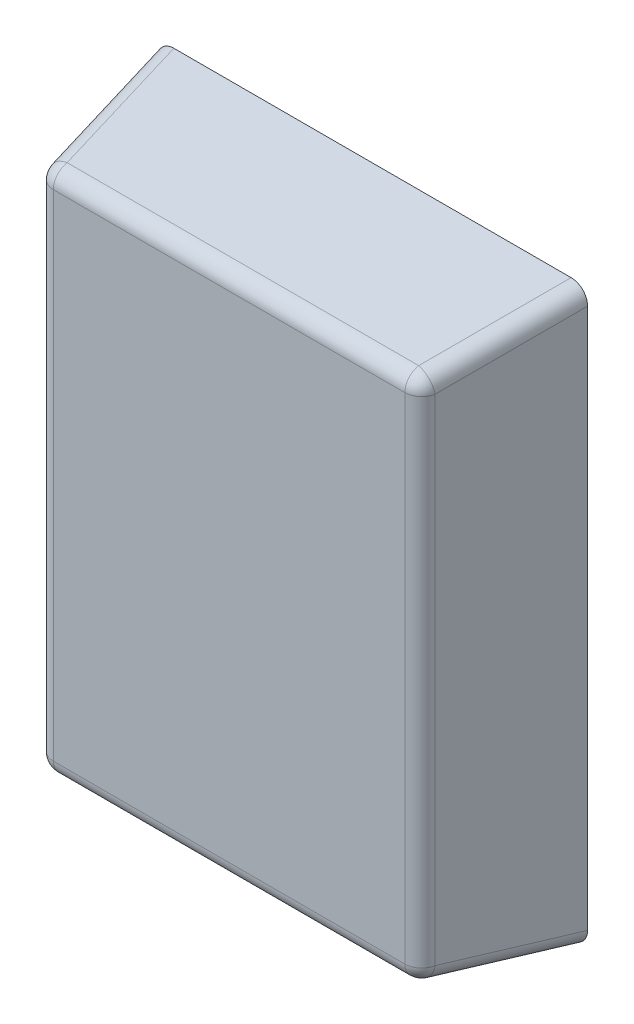
ISO-10303-21;
HEADER;
FILE_DESCRIPTION(('STEP AP214'),'2;1');
FILE_NAME('part.step','',(''),(''),'','','');
FILE_SCHEMA(('AUTOMOTIVE_DESIGN { 1 0 10303 214 1 1 1 1 }'));
ENDSEC;
DATA;
#1=APPLICATION_CONTEXT('core data for automotive mechanical design processes');
#2=APPLICATION_PROTOCOL_DEFINITION('international standard','automotive_design',2000,#1);
#3=PRODUCT_CONTEXT('',#1,'mechanical');
#4=PRODUCT('Part','Part','',(#3));
#5=PRODUCT_RELATED_PRODUCT_CATEGORY('part','',(#4));
#6=PRODUCT_DEFINITION_FORMATION('','',#4);
#7=PRODUCT_DEFINITION_CONTEXT('part definition',#1,'design');
#8=PRODUCT_DEFINITION('design','',#6,#7);
#9=PRODUCT_DEFINITION_SHAPE('','',#8);
#10=(LENGTH_UNIT() NAMED_UNIT(*) SI_UNIT(.MILLI.,.METRE.));
#11=(NAMED_UNIT(*) PLANE_ANGLE_UNIT() SI_UNIT($,.RADIAN.));
#12=(NAMED_UNIT(*) SI_UNIT($,.STERADIAN.) SOLID_ANGLE_UNIT());
#13=UNCERTAINTY_MEASURE_WITH_UNIT(LENGTH_MEASURE(1.E-05),#10,'distance_accuracy_value','');
#14=(GEOMETRIC_REPRESENTATION_CONTEXT(3) GLOBAL_UNCERTAINTY_ASSIGNED_CONTEXT((#13)) GLOBAL_UNIT_ASSIGNED_CONTEXT((#10,
#11,#12)) REPRESENTATION_CONTEXT('',''));
#15=CARTESIAN_POINT('',(0.,0.,0.));
#16=DIRECTION('',(0.,0.,1.));
#17=DIRECTION('',(1.,0.,0.));
#18=AXIS2_PLACEMENT_3D('',#15,#16,#17);
#19=CARTESIAN_POINT('',(1.12653571469062,-0.641019643054923,0.245));
#20=DIRECTION('',(0.,0.,1.));
#21=DIRECTION('',(1.,0.,0.));
#22=AXIS2_PLACEMENT_3D('',#19,#20,#21);
#23=PLANE('',#22);
#24=DIRECTION('',(0.,1.,0.));
#25=VECTOR('',#24,1.);
#26=CARTESIAN_POINT('',(1.20008239842987,-0.581022128259369,0.245));
#27=LINE('',#26,#25);
#28=CARTESIAN_POINT('',(1.20008239842987,-0.537477929724562,0.245));
#29=VERTEX_POINT('',#28);
#30=CARTESIAN_POINT('',(1.20008239842987,-0.744561356385284,0.245));
#31=VERTEX_POINT('',#30);
#32=EDGE_CURVE('E236',#29,#31,#27,.F.);
#33=ORIENTED_EDGE('',*,*,#32,.F.);
#34=DIRECTION('',(-1.,0.,0.));
#35=VECTOR('',#34,1.);
#36=CARTESIAN_POINT('',(1.08153571469062,-0.537477929724562,0.245));
#37=LINE('',#36,#35);
#38=CARTESIAN_POINT('',(1.05298903095137,-0.537477929724562,0.245));
#39=VERTEX_POINT('',#38);
#40=EDGE_CURVE('E224',#39,#29,#37,.F.);
#41=ORIENTED_EDGE('',*,*,#40,.F.);
#42=DIRECTION('',(0.,-1.,0.));
#43=VECTOR('',#42,1.);
#44=CARTESIAN_POINT('',(1.05298903095137,-0.701017157850478,0.245));
#45=LINE('',#44,#43);
#46=CARTESIAN_POINT('',(1.05298903095137,-0.744561356385284,0.245));
#47=VERTEX_POINT('',#46);
#48=EDGE_CURVE('E229',#47,#39,#45,.F.);
#49=ORIENTED_EDGE('',*,*,#48,.F.);
#50=DIRECTION('',(1.,0.,0.));
#51=VECTOR('',#50,1.);
#52=CARTESIAN_POINT('',(1.17153571469062,-0.744561356385284,0.245));
#53=LINE('',#52,#51);
#54=EDGE_CURVE('E241',#31,#47,#53,.F.);
#55=ORIENTED_EDGE('',*,*,#54,.F.);
#56=EDGE_LOOP('',(#33,#41,#49,#55));
#57=FACE_BOUND('',#56,.T.);
#58=ADVANCED_FACE('F17',(#57),#23,.T.);
#59=CARTESIAN_POINT('',(1.05298903095137,-0.701017157850478,0.238));
#60=DIRECTION('',(0.,-1.,0.));
#61=DIRECTION('',(1.,0.,0.));
#62=AXIS2_PLACEMENT_3D('',#59,#60,#61);
#63=CYLINDRICAL_SURFACE('',#62,0.007);
#64=DIRECTION('',(0.,1.,0.));
#65=VECTOR('',#64,1.);
#66=CARTESIAN_POINT('',(1.04609537668028,-0.761014672646032,0.239215537243667));
#67=LINE('',#66,#65);
#68=CARTESIAN_POINT('',(1.04609537668028,-0.744561356385283,0.239215537243667));
#69=VERTEX_POINT('',#68);
#70=CARTESIAN_POINT('',(1.04609537668028,-0.537477929724562,0.239215537243668));
#71=VERTEX_POINT('',#70);
#72=EDGE_CURVE('E114',#69,#71,#67,.T.);
#73=ORIENTED_EDGE('',*,*,#72,.F.);
#74=CARTESIAN_POINT('',(1.05298903095137,-0.744561356385283,0.238));
#75=DIRECTION('',(0.,-1.,-1.82015343698568E-13));
#76=DIRECTION('',(1.,0.,0.));
#77=AXIS2_PLACEMENT_3D('',#74,#75,#76);
#78=CIRCLE('',#77,0.007);
#79=EDGE_CURVE('E221',#47,#69,#78,.T.);
#80=ORIENTED_EDGE('',*,*,#79,.F.);
#81=ORIENTED_EDGE('',*,*,#48,.T.);
#82=CARTESIAN_POINT('',(1.05298903095137,-0.537477929724562,0.238));
#83=DIRECTION('',(0.,-1.,0.));
#84=DIRECTION('',(1.,0.,0.));
#85=AXIS2_PLACEMENT_3D('',#82,#83,#84);
#86=CIRCLE('',#85,0.007);
#87=EDGE_CURVE('E74',#71,#39,#86,.F.);
#88=ORIENTED_EDGE('',*,*,#87,.F.);
#89=EDGE_LOOP('',(#73,#80,#81,#88));
#90=FACE_BOUND('',#89,.T.);
#91=ADVANCED_FACE('F214',(#90),#63,.T.);
#92=CARTESIAN_POINT('',(1.05298903095137,-0.744561356385283,0.238));
#93=DIRECTION('',(1.,0.,0.));
#94=DIRECTION('',(0.,1.,0.));
#95=AXIS2_PLACEMENT_3D('',#92,#93,#94);
#96=SPHERICAL_SURFACE('',#95,0.007);
#97=ORIENTED_EDGE('',*,*,#79,.T.);
#98=CARTESIAN_POINT('',(1.05298903095137,-0.744561356385283,0.238));
#99=DIRECTION('',(-0.171087869746035,-0.171087869746037,-0.970287525247814));
#100=DIRECTION('',(0.,0.984807753012208,-0.173648177666932));
#101=AXIS2_PLACEMENT_3D('',#98,#99,#100);
#102=CIRCLE('',#101,0.007);
#103=CARTESIAN_POINT('',(1.05298903095137,-0.751455010656369,0.239215537243669));
#104=VERTEX_POINT('',#103);
#105=EDGE_CURVE('E20',#104,#69,#102,.T.);
#106=ORIENTED_EDGE('',*,*,#105,.F.);
#107=CARTESIAN_POINT('',(1.05298903095137,-0.744561356385284,0.238));
#108=DIRECTION('',(1.,0.,0.));
#109=DIRECTION('',(0.,1.,0.));
#110=AXIS2_PLACEMENT_3D('',#107,#108,#109);
#111=CIRCLE('',#110,0.007);
#112=EDGE_CURVE('E223',#47,#104,#111,.T.);
#113=ORIENTED_EDGE('',*,*,#112,.F.);
#114=EDGE_LOOP('',(#97,#106,#113));
#115=FACE_BOUND('',#114,.T.);
#116=ADVANCED_FACE('F210',(#115),#96,.T.);
#117=CARTESIAN_POINT('',(1.17153571469062,-0.744561356385284,0.238));
#118=DIRECTION('',(1.,0.,0.));
#119=DIRECTION('',(0.,1.,0.));
#120=AXIS2_PLACEMENT_3D('',#117,#118,#119);
#121=CYLINDRICAL_SURFACE('',#120,0.007);
#122=DIRECTION('',(1.,0.,0.));
#123=VECTOR('',#122,1.);
#124=CARTESIAN_POINT('',(1.21653571469062,-0.75145501065637,0.239215537243668));
#125=LINE('',#124,#123);
#126=CARTESIAN_POINT('',(1.20008239842987,-0.751455010656369,0.239215537243668));
#127=VERTEX_POINT('',#126);
#128=EDGE_CURVE('E146',#127,#104,#125,.F.);
#129=ORIENTED_EDGE('',*,*,#128,.F.);
#130=CARTESIAN_POINT('',(1.20008239842987,-0.744561356385284,0.238));
#131=DIRECTION('',(1.,0.,0.));
#132=DIRECTION('',(0.,1.,0.));
#133=AXIS2_PLACEMENT_3D('',#130,#131,#132);
#134=CIRCLE('',#133,0.00699999999999995);
#135=EDGE_CURVE('E198',#31,#127,#134,.T.);
#136=ORIENTED_EDGE('',*,*,#135,.F.);
#137=ORIENTED_EDGE('',*,*,#54,.T.);
#138=ORIENTED_EDGE('',*,*,#112,.T.);
#139=EDGE_LOOP('',(#129,#136,#137,#138));
#140=FACE_BOUND('',#139,.T.);
#141=ADVANCED_FACE('F206',(#140),#121,.T.);
#142=CARTESIAN_POINT('',(1.20008239842987,-0.744561356385284,0.238));
#143=DIRECTION('',(1.,0.,0.));
#144=DIRECTION('',(0.,1.,0.));
#145=AXIS2_PLACEMENT_3D('',#142,#143,#144);
#146=SPHERICAL_SURFACE('',#145,0.007);
#147=ORIENTED_EDGE('',*,*,#135,.T.);
#148=CARTESIAN_POINT('',(1.20008239842987,-0.744561356385283,0.238));
#149=DIRECTION('',(0.171087869746039,-0.171087869746042,-0.970287525247812));
#150=DIRECTION('',(0.,0.984807753012207,-0.173648177666937));
#151=AXIS2_PLACEMENT_3D('',#148,#149,#150);
#152=CIRCLE('',#151,0.007);
#153=CARTESIAN_POINT('',(1.20697605270095,-0.744561356385284,0.239215537243669));
#154=VERTEX_POINT('',#153);
#155=EDGE_CURVE('E136',#154,#127,#152,.T.);
#156=ORIENTED_EDGE('',*,*,#155,.F.);
#157=CARTESIAN_POINT('',(1.20008239842987,-0.744561356385284,0.238));
#158=DIRECTION('',(0.,1.,0.));
#159=DIRECTION('',(-1.,0.,0.));
#160=AXIS2_PLACEMENT_3D('',#157,#158,#159);
#161=CIRCLE('',#160,0.007);
#162=EDGE_CURVE('E194',#31,#154,#161,.T.);
#163=ORIENTED_EDGE('',*,*,#162,.F.);
#164=EDGE_LOOP('',(#147,#156,#163));
#165=FACE_BOUND('',#164,.T.);
#166=ADVANCED_FACE('F203',(#165),#146,.T.);
#167=CARTESIAN_POINT('',(1.20008239842987,-0.581022128259369,0.238));
#168=DIRECTION('',(0.,1.,0.));
#169=DIRECTION('',(-1.,0.,0.));
#170=AXIS2_PLACEMENT_3D('',#167,#168,#169);
#171=CYLINDRICAL_SURFACE('',#170,0.007);
#172=DIRECTION('',(0.,1.,0.));
#173=VECTOR('',#172,1.);
#174=CARTESIAN_POINT('',(1.20697605270096,-0.521024613463814,0.239215537243669));
#175=LINE('',#174,#173);
#176=CARTESIAN_POINT('',(1.20697605270096,-0.537477929724562,0.239215537243669));
#177=VERTEX_POINT('',#176);
#178=EDGE_CURVE('E137',#177,#154,#175,.F.);
#179=ORIENTED_EDGE('',*,*,#178,.F.);
#180=CARTESIAN_POINT('',(1.20008239842987,-0.537477929724562,0.238));
#181=DIRECTION('',(0.,-1.,0.));
#182=DIRECTION('',(1.,0.,0.));
#183=AXIS2_PLACEMENT_3D('',#180,#181,#182);
#184=CIRCLE('',#183,0.007);
#185=EDGE_CURVE('E190',#29,#177,#184,.F.);
#186=ORIENTED_EDGE('',*,*,#185,.F.);
#187=ORIENTED_EDGE('',*,*,#32,.T.);
#188=ORIENTED_EDGE('',*,*,#162,.T.);
#189=EDGE_LOOP('',(#179,#186,#187,#188));
#190=FACE_BOUND('',#189,.T.);
#191=ADVANCED_FACE('F182',(#190),#171,.T.);
#192=CARTESIAN_POINT('',(1.20008239842987,-0.537477929724562,0.238));
#193=DIRECTION('',(1.,0.,0.));
#194=DIRECTION('',(0.,1.,0.));
#195=AXIS2_PLACEMENT_3D('',#192,#193,#194);
#196=SPHERICAL_SURFACE('',#195,0.007);
#197=CARTESIAN_POINT('',(1.20008239842987,-0.537477929724562,0.238));
#198=DIRECTION('',(-1.,0.,0.));
#199=DIRECTION('',(0.,-1.,0.));
#200=AXIS2_PLACEMENT_3D('',#197,#198,#199);
#201=CIRCLE('',#200,0.007);
#202=CARTESIAN_POINT('',(1.20008239842987,-0.530584275453477,0.239215537243668));
#203=VERTEX_POINT('',#202);
#204=EDGE_CURVE('E193',#29,#203,#201,.T.);
#205=ORIENTED_EDGE('',*,*,#204,.F.);
#206=ORIENTED_EDGE('',*,*,#185,.T.);
#207=CARTESIAN_POINT('',(1.20008239842987,-0.537477929724563,0.238));
#208=DIRECTION('',(0.17108786974604,0.171087869746041,-0.970287525247812));
#209=DIRECTION('',(0.,0.984807753012207,0.173648177666936));
#210=AXIS2_PLACEMENT_3D('',#207,#208,#209);
#211=CIRCLE('',#210,0.007);
#212=EDGE_CURVE('E133',#203,#177,#211,.T.);
#213=ORIENTED_EDGE('',*,*,#212,.F.);
#214=EDGE_LOOP('',(#205,#206,#213));
#215=FACE_BOUND('',#214,.T.);
#216=ADVANCED_FACE('F178',(#215),#196,.T.);
#217=CARTESIAN_POINT('',(1.08153571469062,-0.537477929724562,0.238));
#218=DIRECTION('',(-1.,0.,0.));
#219=DIRECTION('',(0.,-1.,0.));
#220=AXIS2_PLACEMENT_3D('',#217,#218,#219);
#221=CYLINDRICAL_SURFACE('',#220,0.007);
#222=DIRECTION('',(1.,0.,0.));
#223=VECTOR('',#222,1.);
#224=CARTESIAN_POINT('',(1.03653571469062,-0.530584275453476,0.239215537243668));
#225=LINE('',#224,#223);
#226=CARTESIAN_POINT('',(1.05298903095137,-0.530584275453477,0.239215537243668));
#227=VERTEX_POINT('',#226);
#228=EDGE_CURVE('E134',#227,#203,#225,.T.);
#229=ORIENTED_EDGE('',*,*,#228,.F.);
#230=CARTESIAN_POINT('',(1.05298903095137,-0.537477929724562,0.238));
#231=DIRECTION('',(1.,0.,0.));
#232=DIRECTION('',(0.,1.,0.));
#233=AXIS2_PLACEMENT_3D('',#230,#231,#232);
#234=CIRCLE('',#233,0.00699999999999995);
#235=EDGE_CURVE('E82',#39,#227,#234,.F.);
#236=ORIENTED_EDGE('',*,*,#235,.F.);
#237=ORIENTED_EDGE('',*,*,#40,.T.);
#238=ORIENTED_EDGE('',*,*,#204,.T.);
#239=EDGE_LOOP('',(#229,#236,#237,#238));
#240=FACE_BOUND('',#239,.T.);
#241=ADVANCED_FACE('F173',(#240),#221,.T.);
#242=CARTESIAN_POINT('',(1.05298903095137,-0.537477929724562,0.238));
#243=DIRECTION('',(1.,0.,0.));
#244=DIRECTION('',(0.,1.,0.));
#245=AXIS2_PLACEMENT_3D('',#242,#243,#244);
#246=SPHERICAL_SURFACE('',#245,0.007);
#247=ORIENTED_EDGE('',*,*,#87,.T.);
#248=ORIENTED_EDGE('',*,*,#235,.T.);
#249=CARTESIAN_POINT('',(1.05298903095136,-0.537477929724562,0.238));
#250=DIRECTION('',(-0.171087869746029,0.171087869746031,-0.970287525247816));
#251=DIRECTION('',(0.,0.984807753012209,0.173648177666926));
#252=AXIS2_PLACEMENT_3D('',#249,#250,#251);
#253=CIRCLE('',#252,0.007);
#254=EDGE_CURVE('E126',#71,#227,#253,.T.);
#255=ORIENTED_EDGE('',*,*,#254,.F.);
#256=EDGE_LOOP('',(#247,#248,#255));
#257=FACE_BOUND('',#256,.T.);
#258=ADVANCED_FACE('F169',(#257),#246,.T.);
#259=CARTESIAN_POINT('',(1.03653571469062,-0.761014672646032,0.185));
#260=DIRECTION('',(-0.984807753012208,0.,0.173648177666928));
#261=DIRECTION('',(0.173648177666928,0.,0.984807753012208));
#262=AXIS2_PLACEMENT_3D('',#259,#260,#261);
#263=PLANE('',#262);
#264=DIRECTION('',(-0.171087869746035,-0.171087869746037,-0.970287525247814));
#265=VECTOR('',#264,1.);
#266=CARTESIAN_POINT('',(1.0389683254542,-0.751688407611361,0.198796021197729));
#267=LINE('',#266,#265);
#268=CARTESIAN_POINT('',(1.03653571469062,-0.754121018374946,0.185));
#269=VERTEX_POINT('',#268);
#270=EDGE_CURVE('E104',#69,#269,#267,.T.);
#271=ORIENTED_EDGE('',*,*,#270,.F.);
#272=ORIENTED_EDGE('',*,*,#72,.T.);
#273=DIRECTION('',(-0.171087869746033,0.171087869746029,-0.970287525247815));
#274=VECTOR('',#273,1.);
#275=CARTESIAN_POINT('',(1.04609537668028,-0.537477929724562,0.239215537243667));
#276=LINE('',#275,#274);
#277=CARTESIAN_POINT('',(1.03653571469062,-0.527918267734899,0.185));
#278=VERTEX_POINT('',#277);
#279=EDGE_CURVE('E111',#71,#278,#276,.T.);
#280=ORIENTED_EDGE('',*,*,#279,.T.);
#281=DIRECTION('',(0.,1.,0.));
#282=VECTOR('',#281,1.);
#283=CARTESIAN_POINT('',(1.03653571469062,-0.641019643054923,0.185));
#284=LINE('',#283,#282);
#285=EDGE_CURVE('E113',#278,#269,#284,.F.);
#286=ORIENTED_EDGE('',*,*,#285,.T.);
#287=EDGE_LOOP('',(#271,#272,#280,#286));
#288=FACE_BOUND('',#287,.T.);
#289=ADVANCED_FACE('F112',(#288),#263,.T.);
#290=CARTESIAN_POINT('',(1.04586197972529,-0.751688407611361,0.197580483954061));
#291=DIRECTION('',(-0.171087869746035,-0.171087869746037,-0.970287525247814));
#292=DIRECTION('',(0.,0.984807753012208,-0.173648177666932));
#293=AXIS2_PLACEMENT_3D('',#290,#291,#292);
#294=CYLINDRICAL_SURFACE('',#293,0.007);
#295=DIRECTION('',(-0.171087869746156,-0.171087869746034,-0.970287525247793));
#296=VECTOR('',#295,1.);
#297=CARTESIAN_POINT('',(1.05298903095137,-0.751455010656369,0.239215537243668));
#298=LINE('',#297,#296);
#299=CARTESIAN_POINT('',(1.0434293689617,-0.761014672646032,0.185));
#300=VERTEX_POINT('',#299);
#301=EDGE_CURVE('E151',#104,#300,#298,.T.);
#302=ORIENTED_EDGE('',*,*,#301,.F.);
#303=ORIENTED_EDGE('',*,*,#105,.T.);
#304=ORIENTED_EDGE('',*,*,#270,.T.);
#305=CARTESIAN_POINT('',(1.04364370097382,-0.753906686362832,0.185));
#306=DIRECTION('',(0.,0.,1.));
#307=DIRECTION('',(-0.707106781186543,-0.707106781186552,0.));
#308=AXIS2_PLACEMENT_3D('',#305,#306,#307);
#309=ELLIPSE('',#308,0.00721435638184896,0.007);
#310=EDGE_CURVE('E120',#269,#300,#309,.T.);
#311=ORIENTED_EDGE('',*,*,#310,.T.);
#312=EDGE_LOOP('',(#302,#303,#304,#311));
#313=FACE_BOUND('',#312,.T.);
#314=ADVANCED_FACE('F279',(#313),#294,.T.);
#315=CARTESIAN_POINT('',(1.21653571469062,-0.761014672646033,0.185));
#316=DIRECTION('',(0.,-0.984807753012208,0.173648177666931));
#317=DIRECTION('',(0.,-0.173648177666931,-0.984807753012208));
#318=AXIS2_PLACEMENT_3D('',#315,#316,#317);
#319=PLANE('',#318);
#320=DIRECTION('',(0.171087869746039,-0.171087869746042,-0.970287525247812));
#321=VECTOR('',#320,1.);
#322=CARTESIAN_POINT('',(1.20633146336985,-0.757704075596352,0.20377532885993));
#323=LINE('',#322,#321);
#324=CARTESIAN_POINT('',(1.20964206041953,-0.761014672646032,0.185));
#325=VERTEX_POINT('',#324);
#326=EDGE_CURVE('E138',#127,#325,#323,.T.);
#327=ORIENTED_EDGE('',*,*,#326,.F.);
#328=ORIENTED_EDGE('',*,*,#128,.T.);
#329=ORIENTED_EDGE('',*,*,#301,.T.);
#330=DIRECTION('',(1.,0.,0.));
#331=VECTOR('',#330,1.);
#332=CARTESIAN_POINT('',(1.12653571469062,-0.761014672646032,0.185));
#333=LINE('',#332,#331);
#334=EDGE_CURVE('E156',#300,#325,#333,.T.);
#335=ORIENTED_EDGE('',*,*,#334,.T.);
#336=EDGE_LOOP('',(#327,#328,#329,#335));
#337=FACE_BOUND('',#336,.T.);
#338=ADVANCED_FACE('F271',(#337),#319,.T.);
#339=CARTESIAN_POINT('',(1.20633146336985,-0.750810421325267,0.202559791616261));
#340=DIRECTION('',(0.171087869746039,-0.171087869746042,-0.970287525247812));
#341=DIRECTION('',(0.,0.984807753012207,-0.173648177666937));
#342=AXIS2_PLACEMENT_3D('',#339,#340,#341);
#343=CYLINDRICAL_SURFACE('',#342,0.007);
#344=DIRECTION('',(0.171087869746036,-0.171087869746028,-0.970287525247815));
#345=VECTOR('',#344,1.);
#346=CARTESIAN_POINT('',(1.20697605270096,-0.744561356385284,0.239215537243669));
#347=LINE('',#346,#345);
#348=CARTESIAN_POINT('',(1.21653571469062,-0.754121018374947,0.185));
#349=VERTEX_POINT('',#348);
#350=EDGE_CURVE('E144',#154,#349,#347,.T.);
#351=ORIENTED_EDGE('',*,*,#350,.F.);
#352=ORIENTED_EDGE('',*,*,#155,.T.);
#353=ORIENTED_EDGE('',*,*,#326,.T.);
#354=CARTESIAN_POINT('',(1.20942772840742,-0.753906686362832,0.185));
#355=DIRECTION('',(0.,0.,1.));
#356=DIRECTION('',(0.707106781186541,-0.707106781186554,0.));
#357=AXIS2_PLACEMENT_3D('',#354,#355,#356);
#358=ELLIPSE('',#357,0.00721435638184897,0.007);
#359=EDGE_CURVE('E159',#325,#349,#358,.T.);
#360=ORIENTED_EDGE('',*,*,#359,.T.);
#361=EDGE_LOOP('',(#351,#352,#353,#360));
#362=FACE_BOUND('',#361,.T.);
#363=ADVANCED_FACE('F269',(#362),#343,.T.);
#364=CARTESIAN_POINT('',(1.21653571469062,-0.521024613463814,0.185));
#365=DIRECTION('',(0.984807753012208,0.,0.173648177666929));
#366=DIRECTION('',(0.173648177666929,0.,-0.984807753012208));
#367=AXIS2_PLACEMENT_3D('',#364,#365,#366);
#368=PLANE('',#367);
#369=ORIENTED_EDGE('',*,*,#350,.T.);
#370=DIRECTION('',(0.,1.,0.));
#371=VECTOR('',#370,1.);
#372=CARTESIAN_POINT('',(1.21653571469062,-0.641019643054923,0.185));
#373=LINE('',#372,#371);
#374=CARTESIAN_POINT('',(1.21653571469062,-0.527918267734899,0.185));
#375=VERTEX_POINT('',#374);
#376=EDGE_CURVE('E248',#349,#375,#373,.T.);
#377=ORIENTED_EDGE('',*,*,#376,.T.);
#378=DIRECTION('',(0.17108786974604,0.171087869746041,-0.970287525247812));
#379=VECTOR('',#378,1.);
#380=CARTESIAN_POINT('',(1.21410310392704,-0.530350878498484,0.19879602119773));
#381=LINE('',#380,#379);
#382=EDGE_CURVE('E135',#177,#375,#381,.T.);
#383=ORIENTED_EDGE('',*,*,#382,.F.);
#384=ORIENTED_EDGE('',*,*,#178,.T.);
#385=EDGE_LOOP('',(#369,#377,#383,#384));
#386=FACE_BOUND('',#385,.T.);
#387=ADVANCED_FACE('F264',(#386),#368,.T.);
#388=CARTESIAN_POINT('',(1.20720944965595,-0.530350878498485,0.197580483954061));
#389=DIRECTION('',(0.17108786974604,0.171087869746041,-0.970287525247812));
#390=DIRECTION('',(0.,0.984807753012207,0.173648177666936));
#391=AXIS2_PLACEMENT_3D('',#388,#389,#390);
#392=CYLINDRICAL_SURFACE('',#391,0.007);
#393=DIRECTION('',(0.171087869745975,0.171087869746037,-0.970287525247824));
#394=VECTOR('',#393,1.);
#395=CARTESIAN_POINT('',(1.20008239842987,-0.530584275453476,0.239215537243668));
#396=LINE('',#395,#394);
#397=CARTESIAN_POINT('',(1.20964206041953,-0.521024613463814,0.185));
#398=VERTEX_POINT('',#397);
#399=EDGE_CURVE('E132',#203,#398,#396,.T.);
#400=ORIENTED_EDGE('',*,*,#399,.F.);
#401=ORIENTED_EDGE('',*,*,#212,.T.);
#402=ORIENTED_EDGE('',*,*,#382,.T.);
#403=CARTESIAN_POINT('',(1.20942772840742,-0.528132599747014,0.185));
#404=DIRECTION('',(0.,0.,1.));
#405=DIRECTION('',(0.707106781186545,0.70710678118655,0.));
#406=AXIS2_PLACEMENT_3D('',#403,#404,#405);
#407=ELLIPSE('',#406,0.00721435638184897,0.007);
#408=EDGE_CURVE('E26',#375,#398,#407,.T.);
#409=ORIENTED_EDGE('',*,*,#408,.T.);
#410=EDGE_LOOP('',(#400,#401,#402,#409));
#411=FACE_BOUND('',#410,.T.);
#412=ADVANCED_FACE('F263',(#411),#392,.T.);
#413=CARTESIAN_POINT('',(1.03653571469062,-0.521024613463813,0.185));
#414=DIRECTION('',(0.,0.984807753012208,0.17364817766693));
#415=DIRECTION('',(0.,-0.17364817766693,0.984807753012208));
#416=AXIS2_PLACEMENT_3D('',#413,#414,#415);
#417=PLANE('',#416);
#418=ORIENTED_EDGE('',*,*,#399,.T.);
#419=DIRECTION('',(1.,0.,0.));
#420=VECTOR('',#419,1.);
#421=CARTESIAN_POINT('',(1.12653571469062,-0.521024613463814,0.185));
#422=LINE('',#421,#420);
#423=CARTESIAN_POINT('',(1.0434293689617,-0.521024613463813,0.185));
#424=VERTEX_POINT('',#423);
#425=EDGE_CURVE('E11',#398,#424,#422,.F.);
#426=ORIENTED_EDGE('',*,*,#425,.T.);
#427=DIRECTION('',(-0.171087869746027,0.171087869746035,-0.970287525247815));
#428=VECTOR('',#427,1.);
#429=CARTESIAN_POINT('',(1.05298903095136,-0.530584275453477,0.239215537243669));
#430=LINE('',#429,#428);
#431=EDGE_CURVE('E124',#227,#424,#430,.T.);
#432=ORIENTED_EDGE('',*,*,#431,.F.);
#433=ORIENTED_EDGE('',*,*,#228,.T.);
#434=EDGE_LOOP('',(#418,#426,#432,#433));
#435=FACE_BOUND('',#434,.T.);
#436=ADVANCED_FACE('F259',(#435),#417,.T.);
#437=CARTESIAN_POINT('',(1.04673996601138,-0.531228864784579,0.202559791616261));
#438=DIRECTION('',(-0.171087869746029,0.171087869746031,-0.970287525247816));
#439=DIRECTION('',(0.,0.984807753012209,0.173648177666926));
#440=AXIS2_PLACEMENT_3D('',#437,#438,#439);
#441=CYLINDRICAL_SURFACE('',#440,0.007);
#442=ORIENTED_EDGE('',*,*,#431,.T.);
#443=CARTESIAN_POINT('',(1.04364370097382,-0.528132599747014,0.185));
#444=DIRECTION('',(0.,0.,1.));
#445=DIRECTION('',(-0.707106781186543,0.707106781186552,0.));
#446=AXIS2_PLACEMENT_3D('',#443,#444,#445);
#447=ELLIPSE('',#446,0.00721435638184894,0.007);
#448=EDGE_CURVE('E35',#424,#278,#447,.T.);
#449=ORIENTED_EDGE('',*,*,#448,.T.);
#450=ORIENTED_EDGE('',*,*,#279,.F.);
#451=ORIENTED_EDGE('',*,*,#254,.T.);
#452=EDGE_LOOP('',(#442,#449,#450,#451));
#453=FACE_BOUND('',#452,.T.);
#454=ADVANCED_FACE('F122',(#453),#441,.T.);
#455=CARTESIAN_POINT('',(1.12653571469062,-0.641019643054923,0.185));
#456=DIRECTION('',(0.,0.,1.));
#457=DIRECTION('',(1.,0.,0.));
#458=AXIS2_PLACEMENT_3D('',#455,#456,#457);
#459=PLANE('',#458);
#460=ORIENTED_EDGE('',*,*,#425,.F.);
#461=ORIENTED_EDGE('',*,*,#408,.F.);
#462=ORIENTED_EDGE('',*,*,#376,.F.);
#463=ORIENTED_EDGE('',*,*,#359,.F.);
#464=ORIENTED_EDGE('',*,*,#334,.F.);
#465=ORIENTED_EDGE('',*,*,#310,.F.);
#466=ORIENTED_EDGE('',*,*,#285,.F.);
#467=ORIENTED_EDGE('',*,*,#448,.F.);
#468=EDGE_LOOP('',(#460,#461,#462,#463,#464,#465,#466,#467));
#469=FACE_BOUND('',#468,.T.);
#470=ADVANCED_FACE('F118',(#469),#459,.F.);
#471=CLOSED_SHELL('',(#58,#91,#116,#141,#166,#191,#216,#241,#258,#289,#314,#338,#363,#387,#412,
#436,#454,#470));
#472=MANIFOLD_SOLID_BREP('B1',#471);
#473=ADVANCED_BREP_SHAPE_REPRESENTATION('',(#18,#472),#14);
#474=SHAPE_DEFINITION_REPRESENTATION(#9,#473);
ENDSEC;
END-ISO-10303-21;
